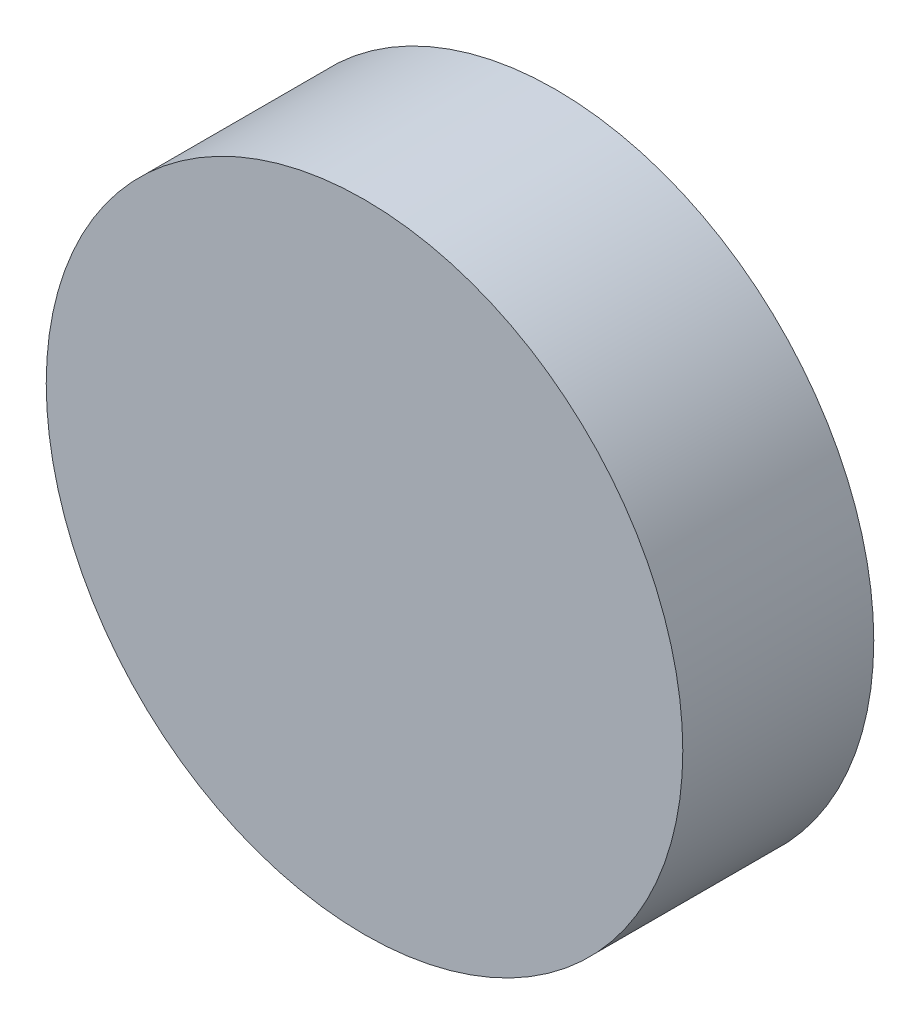
ISO-10303-21;
HEADER;
FILE_DESCRIPTION(('STEP AP214'),'2;1');
FILE_NAME('part.step','',(''),(''),'','','');
FILE_SCHEMA(('AUTOMOTIVE_DESIGN { 1 0 10303 214 1 1 1 1 }'));
ENDSEC;
DATA;
#1=APPLICATION_CONTEXT('core data for automotive mechanical design processes');
#2=APPLICATION_PROTOCOL_DEFINITION('international standard','automotive_design',2000,#1);
#3=PRODUCT_CONTEXT('',#1,'mechanical');
#4=PRODUCT('Part','Part','',(#3));
#5=PRODUCT_RELATED_PRODUCT_CATEGORY('part','',(#4));
#6=PRODUCT_DEFINITION_FORMATION('','',#4);
#7=PRODUCT_DEFINITION_CONTEXT('part definition',#1,'design');
#8=PRODUCT_DEFINITION('design','',#6,#7);
#9=PRODUCT_DEFINITION_SHAPE('','',#8);
#10=(LENGTH_UNIT() NAMED_UNIT(*) SI_UNIT(.MILLI.,.METRE.));
#11=(NAMED_UNIT(*) PLANE_ANGLE_UNIT() SI_UNIT($,.RADIAN.));
#12=(NAMED_UNIT(*) SI_UNIT($,.STERADIAN.) SOLID_ANGLE_UNIT());
#13=UNCERTAINTY_MEASURE_WITH_UNIT(LENGTH_MEASURE(1.E-05),#10,'distance_accuracy_value','');
#14=(GEOMETRIC_REPRESENTATION_CONTEXT(3) GLOBAL_UNCERTAINTY_ASSIGNED_CONTEXT((#13)) GLOBAL_UNIT_ASSIGNED_CONTEXT((#10,
#11,#12)) REPRESENTATION_CONTEXT('',''));
#15=CARTESIAN_POINT('',(0.,0.,0.));
#16=DIRECTION('',(0.,0.,1.));
#17=DIRECTION('',(1.,0.,0.));
#18=AXIS2_PLACEMENT_3D('',#15,#16,#17);
#19=CARTESIAN_POINT('',(0.,0.,0.));
#20=DIRECTION('',(0.,0.,1.));
#21=DIRECTION('',(1.,0.,0.));
#22=AXIS2_PLACEMENT_3D('',#19,#20,#21);
#23=PLANE('',#22);
#24=DIRECTION('',(0.475509024778266,-0.879710843035609,0.));
#25=VECTOR('',#24,1.);
#26=CARTESIAN_POINT('',(-4.90554595259711,0.137667135843847,0.));
#27=LINE('',#26,#25);
#28=CARTESIAN_POINT('',(-4.90554595259711,0.137667135843847,0.));
#29=VERTEX_POINT('',#28);
#30=CARTESIAN_POINT('',(-2.57199621320557,-4.17949384645911,0.));
#31=VERTEX_POINT('',#30);
#32=EDGE_CURVE('E134',#29,#31,#27,.T.);
#33=ORIENTED_EDGE('',*,*,#32,.F.);
#34=DIRECTION('',(-0.524097425664329,-0.851658316704547,0.));
#35=VECTOR('',#34,1.);
#36=CARTESIAN_POINT('',(-2.33354973939154,4.31716098230296,0.));
#37=LINE('',#36,#35);
#38=CARTESIAN_POINT('',(-2.33354973939154,4.31716098230296,0.));
#39=VERTEX_POINT('',#38);
#40=EDGE_CURVE('E85',#39,#29,#37,.T.);
#41=ORIENTED_EDGE('',*,*,#40,.F.);
#42=DIRECTION('',(-0.999606450442596,0.0280525263310623,0.));
#43=VECTOR('',#42,1.);
#44=CARTESIAN_POINT('',(2.57199621320557,4.17949384645911,0.));
#45=LINE('',#44,#43);
#46=CARTESIAN_POINT('',(2.57199621320557,4.17949384645911,0.));
#47=VERTEX_POINT('',#46);
#48=EDGE_CURVE('E143',#47,#39,#45,.T.);
#49=ORIENTED_EDGE('',*,*,#48,.F.);
#50=DIRECTION('',(-0.475509024778266,0.879710843035609,0.));
#51=VECTOR('',#50,1.);
#52=CARTESIAN_POINT('',(4.90554595259711,-0.137667135843847,0.));
#53=LINE('',#52,#51);
#54=CARTESIAN_POINT('',(4.90554595259711,-0.137667135843847,0.));
#55=VERTEX_POINT('',#54);
#56=EDGE_CURVE('E141',#55,#47,#53,.T.);
#57=ORIENTED_EDGE('',*,*,#56,.F.);
#58=DIRECTION('',(0.524097425664329,0.851658316704547,0.));
#59=VECTOR('',#58,1.);
#60=CARTESIAN_POINT('',(2.33354973939154,-4.31716098230296,0.));
#61=LINE('',#60,#59);
#62=CARTESIAN_POINT('',(2.33354973939154,-4.31716098230296,0.));
#63=VERTEX_POINT('',#62);
#64=EDGE_CURVE('E109',#63,#55,#61,.T.);
#65=ORIENTED_EDGE('',*,*,#64,.F.);
#66=DIRECTION('',(0.999606450442596,-0.0280525263310624,0.));
#67=VECTOR('',#66,1.);
#68=CARTESIAN_POINT('',(-2.57199621320557,-4.17949384645911,0.));
#69=LINE('',#68,#67);
#70=EDGE_CURVE('E137',#31,#63,#69,.T.);
#71=ORIENTED_EDGE('',*,*,#70,.F.);
#72=EDGE_LOOP('',(#33,#41,#49,#57,#65,#71));
#73=FACE_BOUND('',#72,.T.);
#74=DIRECTION('',(-0.475509024778266,0.879710843035609,0.));
#75=VECTOR('',#74,1.);
#76=CARTESIAN_POINT('',(4.21299828870105,-0.118231775489421,0.));
#77=LINE('',#76,#75);
#78=CARTESIAN_POINT('',(4.21299828870105,-0.118231775489422,0.));
#79=VERTEX_POINT('',#78);
#80=CARTESIAN_POINT('',(2.2088908654589,3.58944765637077,0.));
#81=VERTEX_POINT('',#80);
#82=EDGE_CURVE('E49',#79,#81,#77,.T.);
#83=ORIENTED_EDGE('',*,*,#82,.T.);
#84=DIRECTION('',(-0.999606450442595,0.0280525263310623,0.));
#85=VECTOR('',#84,1.);
#86=CARTESIAN_POINT('',(2.2088908654589,3.58944765637077,0.));
#87=LINE('',#86,#85);
#88=CARTESIAN_POINT('',(-2.00410742324215,3.70767943186019,0.));
#89=VERTEX_POINT('',#88);
#90=EDGE_CURVE('E188',#81,#89,#87,.T.);
#91=ORIENTED_EDGE('',*,*,#90,.T.);
#92=DIRECTION('',(-0.524097425664329,-0.851658316704547,0.));
#93=VECTOR('',#92,1.);
#94=CARTESIAN_POINT('',(-2.00410742324215,3.70767943186019,0.));
#95=LINE('',#94,#93);
#96=CARTESIAN_POINT('',(-4.21299828870105,0.118231775489422,0.));
#97=VERTEX_POINT('',#96);
#98=EDGE_CURVE('E185',#89,#97,#95,.T.);
#99=ORIENTED_EDGE('',*,*,#98,.T.);
#100=DIRECTION('',(0.475509024778266,-0.87971084303561,0.));
#101=VECTOR('',#100,1.);
#102=CARTESIAN_POINT('',(-4.21299828870105,0.118231775489422,0.));
#103=LINE('',#102,#101);
#104=CARTESIAN_POINT('',(-2.2088908654589,-3.58944765637077,0.));
#105=VERTEX_POINT('',#104);
#106=EDGE_CURVE('E182',#97,#105,#103,.T.);
#107=ORIENTED_EDGE('',*,*,#106,.T.);
#108=DIRECTION('',(0.999606450442595,-0.0280525263310624,0.));
#109=VECTOR('',#108,1.);
#110=CARTESIAN_POINT('',(-2.2088908654589,-3.58944765637077,0.));
#111=LINE('',#110,#109);
#112=CARTESIAN_POINT('',(2.00410742324215,-3.70767943186019,0.));
#113=VERTEX_POINT('',#112);
#114=EDGE_CURVE('E179',#105,#113,#111,.T.);
#115=ORIENTED_EDGE('',*,*,#114,.T.);
#116=DIRECTION('',(0.524097425664329,0.851658316704547,0.));
#117=VECTOR('',#116,1.);
#118=CARTESIAN_POINT('',(2.00410742324215,-3.70767943186019,0.));
#119=LINE('',#118,#117);
#120=EDGE_CURVE('E176',#113,#79,#119,.T.);
#121=ORIENTED_EDGE('',*,*,#120,.T.);
#122=EDGE_LOOP('',(#83,#91,#99,#107,#115,#121));
#123=FACE_BOUND('',#122,.T.);
#124=ADVANCED_FACE('F34',(#73,#123),#23,.F.);
#125=CARTESIAN_POINT('',(-4.90554595259711,0.137667135843847,2.));
#126=DIRECTION('',(0.879710843035609,0.475509024778266,0.));
#127=DIRECTION('',(-0.475509024778266,0.879710843035609,0.));
#128=AXIS2_PLACEMENT_3D('',#125,#126,#127);
#129=PLANE('',#128);
#130=ORIENTED_EDGE('',*,*,#32,.T.);
#131=DIRECTION('',(0.,0.,-1.));
#132=VECTOR('',#131,1.);
#133=CARTESIAN_POINT('',(-2.57199621320557,-4.17949384645911,2.));
#134=LINE('',#133,#132);
#135=CARTESIAN_POINT('',(-2.57199621320557,-4.17949384645911,2.));
#136=VERTEX_POINT('',#135);
#137=EDGE_CURVE('E11',#136,#31,#134,.T.);
#138=ORIENTED_EDGE('',*,*,#137,.F.);
#139=DIRECTION('',(0.475509024778266,-0.879710843035609,0.));
#140=VECTOR('',#139,1.);
#141=CARTESIAN_POINT('',(-4.90554595259711,0.137667135843847,2.));
#142=LINE('',#141,#140);
#143=CARTESIAN_POINT('',(-4.90554595259711,0.137667135843847,2.));
#144=VERTEX_POINT('',#143);
#145=EDGE_CURVE('E126',#144,#136,#142,.T.);
#146=ORIENTED_EDGE('',*,*,#145,.F.);
#147=DIRECTION('',(0.,0.,-1.));
#148=VECTOR('',#147,1.);
#149=CARTESIAN_POINT('',(-4.90554595259711,0.137667135843847,2.));
#150=LINE('',#149,#148);
#151=EDGE_CURVE('E133',#144,#29,#150,.T.);
#152=ORIENTED_EDGE('',*,*,#151,.T.);
#153=EDGE_LOOP('',(#130,#138,#146,#152));
#154=FACE_BOUND('',#153,.T.);
#155=ADVANCED_FACE('F36',(#154),#129,.F.);
#156=CARTESIAN_POINT('',(-2.57199621320557,-4.17949384645911,2.));
#157=DIRECTION('',(0.0280525263310624,0.999606450442595,0.));
#158=DIRECTION('',(-0.999606450442595,0.0280525263310624,0.));
#159=AXIS2_PLACEMENT_3D('',#156,#157,#158);
#160=PLANE('',#159);
#161=ORIENTED_EDGE('',*,*,#70,.T.);
#162=DIRECTION('',(0.,0.,-1.));
#163=VECTOR('',#162,1.);
#164=CARTESIAN_POINT('',(2.33354973939154,-4.31716098230296,2.));
#165=LINE('',#164,#163);
#166=CARTESIAN_POINT('',(2.33354973939154,-4.31716098230296,2.));
#167=VERTEX_POINT('',#166);
#168=EDGE_CURVE('E42',#167,#63,#165,.T.);
#169=ORIENTED_EDGE('',*,*,#168,.F.);
#170=DIRECTION('',(0.999606450442596,-0.0280525263310624,0.));
#171=VECTOR('',#170,1.);
#172=CARTESIAN_POINT('',(-2.57199621320557,-4.17949384645911,2.));
#173=LINE('',#172,#171);
#174=EDGE_CURVE('E93',#136,#167,#173,.T.);
#175=ORIENTED_EDGE('',*,*,#174,.F.);
#176=ORIENTED_EDGE('',*,*,#137,.T.);
#177=EDGE_LOOP('',(#161,#169,#175,#176));
#178=FACE_BOUND('',#177,.T.);
#179=ADVANCED_FACE('F272',(#178),#160,.F.);
#180=CARTESIAN_POINT('',(2.33354973939154,-4.31716098230296,2.));
#181=DIRECTION('',(-0.851658316704547,0.524097425664329,0.));
#182=DIRECTION('',(-0.524097425664329,-0.851658316704547,0.));
#183=AXIS2_PLACEMENT_3D('',#180,#181,#182);
#184=PLANE('',#183);
#185=ORIENTED_EDGE('',*,*,#64,.T.);
#186=DIRECTION('',(0.,0.,-1.));
#187=VECTOR('',#186,1.);
#188=CARTESIAN_POINT('',(4.90554595259711,-0.137667135843847,2.));
#189=LINE('',#188,#187);
#190=CARTESIAN_POINT('',(4.90554595259711,-0.137667135843847,2.));
#191=VERTEX_POINT('',#190);
#192=EDGE_CURVE('E102',#191,#55,#189,.T.);
#193=ORIENTED_EDGE('',*,*,#192,.F.);
#194=DIRECTION('',(0.524097425664329,0.851658316704547,0.));
#195=VECTOR('',#194,1.);
#196=CARTESIAN_POINT('',(2.33354973939154,-4.31716098230296,2.));
#197=LINE('',#196,#195);
#198=EDGE_CURVE('E107',#167,#191,#197,.T.);
#199=ORIENTED_EDGE('',*,*,#198,.F.);
#200=ORIENTED_EDGE('',*,*,#168,.T.);
#201=EDGE_LOOP('',(#185,#193,#199,#200));
#202=FACE_BOUND('',#201,.T.);
#203=ADVANCED_FACE('F104',(#202),#184,.F.);
#204=CARTESIAN_POINT('',(4.90554595259711,-0.137667135843847,2.));
#205=DIRECTION('',(-0.879710843035609,-0.475509024778266,0.));
#206=DIRECTION('',(0.475509024778266,-0.879710843035609,0.));
#207=AXIS2_PLACEMENT_3D('',#204,#205,#206);
#208=PLANE('',#207);
#209=ORIENTED_EDGE('',*,*,#56,.T.);
#210=DIRECTION('',(0.,0.,-1.));
#211=VECTOR('',#210,1.);
#212=CARTESIAN_POINT('',(2.57199621320557,4.17949384645911,2.));
#213=LINE('',#212,#211);
#214=CARTESIAN_POINT('',(2.57199621320557,4.17949384645911,2.));
#215=VERTEX_POINT('',#214);
#216=EDGE_CURVE('E112',#215,#47,#213,.T.);
#217=ORIENTED_EDGE('',*,*,#216,.F.);
#218=DIRECTION('',(-0.475509024778266,0.879710843035609,0.));
#219=VECTOR('',#218,1.);
#220=CARTESIAN_POINT('',(4.90554595259711,-0.137667135843847,2.));
#221=LINE('',#220,#219);
#222=EDGE_CURVE('E115',#191,#215,#221,.T.);
#223=ORIENTED_EDGE('',*,*,#222,.F.);
#224=ORIENTED_EDGE('',*,*,#192,.T.);
#225=EDGE_LOOP('',(#209,#217,#223,#224));
#226=FACE_BOUND('',#225,.T.);
#227=ADVANCED_FACE('F116',(#226),#208,.F.);
#228=CARTESIAN_POINT('',(2.57199621320557,4.17949384645911,2.));
#229=DIRECTION('',(-0.0280525263310623,-0.999606450442595,0.));
#230=DIRECTION('',(0.999606450442595,-0.0280525263310623,0.));
#231=AXIS2_PLACEMENT_3D('',#228,#229,#230);
#232=PLANE('',#231);
#233=ORIENTED_EDGE('',*,*,#48,.T.);
#234=DIRECTION('',(0.,0.,-1.));
#235=VECTOR('',#234,1.);
#236=CARTESIAN_POINT('',(-2.33354973939154,4.31716098230296,2.));
#237=LINE('',#236,#235);
#238=CARTESIAN_POINT('',(-2.33354973939154,4.31716098230296,2.));
#239=VERTEX_POINT('',#238);
#240=EDGE_CURVE('E58',#239,#39,#237,.T.);
#241=ORIENTED_EDGE('',*,*,#240,.F.);
#242=DIRECTION('',(-0.999606450442596,0.0280525263310623,0.));
#243=VECTOR('',#242,1.);
#244=CARTESIAN_POINT('',(2.57199621320557,4.17949384645911,2.));
#245=LINE('',#244,#243);
#246=EDGE_CURVE('E120',#215,#239,#245,.T.);
#247=ORIENTED_EDGE('',*,*,#246,.F.);
#248=ORIENTED_EDGE('',*,*,#216,.T.);
#249=EDGE_LOOP('',(#233,#241,#247,#248));
#250=FACE_BOUND('',#249,.T.);
#251=ADVANCED_FACE('F152',(#250),#232,.F.);
#252=CARTESIAN_POINT('',(-2.33354973939154,4.31716098230296,2.));
#253=DIRECTION('',(0.851658316704547,-0.524097425664329,0.));
#254=DIRECTION('',(0.524097425664329,0.851658316704547,0.));
#255=AXIS2_PLACEMENT_3D('',#252,#253,#254);
#256=PLANE('',#255);
#257=ORIENTED_EDGE('',*,*,#40,.T.);
#258=ORIENTED_EDGE('',*,*,#151,.F.);
#259=DIRECTION('',(-0.524097425664329,-0.851658316704547,0.));
#260=VECTOR('',#259,1.);
#261=CARTESIAN_POINT('',(-2.33354973939154,4.31716098230296,2.));
#262=LINE('',#261,#260);
#263=EDGE_CURVE('E131',#239,#144,#262,.T.);
#264=ORIENTED_EDGE('',*,*,#263,.F.);
#265=ORIENTED_EDGE('',*,*,#240,.T.);
#266=EDGE_LOOP('',(#257,#258,#264,#265));
#267=FACE_BOUND('',#266,.T.);
#268=ADVANCED_FACE('F158',(#267),#256,.F.);
#269=CARTESIAN_POINT('',(4.21299828870105,-0.118231775489421,2.));
#270=DIRECTION('',(-0.879710843035609,-0.475509024778266,0.));
#271=DIRECTION('',(0.475509024778266,-0.879710843035609,0.));
#272=AXIS2_PLACEMENT_3D('',#269,#270,#271);
#273=PLANE('',#272);
#274=ORIENTED_EDGE('',*,*,#82,.F.);
#275=DIRECTION('',(0.,0.,-1.));
#276=VECTOR('',#275,1.);
#277=CARTESIAN_POINT('',(4.21299828870105,-0.118231775489421,2.));
#278=LINE('',#277,#276);
#279=CARTESIAN_POINT('',(4.21299828870105,-0.118231775489421,4.));
#280=VERTEX_POINT('',#279);
#281=EDGE_CURVE('E174',#280,#79,#278,.T.);
#282=ORIENTED_EDGE('',*,*,#281,.F.);
#283=DIRECTION('',(0.475509024778266,-0.879710843035609,0.));
#284=VECTOR('',#283,1.);
#285=CARTESIAN_POINT('',(2.2088908654589,3.58944765637077,4.));
#286=LINE('',#285,#284);
#287=CARTESIAN_POINT('',(2.2088908654589,3.58944765637077,4.));
#288=VERTEX_POINT('',#287);
#289=EDGE_CURVE('E210',#288,#280,#286,.T.);
#290=ORIENTED_EDGE('',*,*,#289,.F.);
#291=DIRECTION('',(0.,0.,-1.));
#292=VECTOR('',#291,1.);
#293=CARTESIAN_POINT('',(2.2088908654589,3.58944765637077,2.));
#294=LINE('',#293,#292);
#295=EDGE_CURVE('E138',#288,#81,#294,.T.);
#296=ORIENTED_EDGE('',*,*,#295,.T.);
#297=EDGE_LOOP('',(#274,#282,#290,#296));
#298=FACE_BOUND('',#297,.T.);
#299=ADVANCED_FACE('F265',(#298),#273,.T.);
#300=CARTESIAN_POINT('',(2.2088908654589,3.58944765637077,2.));
#301=DIRECTION('',(-0.0280525263310623,-0.999606450442595,0.));
#302=DIRECTION('',(0.999606450442595,-0.0280525263310623,0.));
#303=AXIS2_PLACEMENT_3D('',#300,#301,#302);
#304=PLANE('',#303);
#305=ORIENTED_EDGE('',*,*,#90,.F.);
#306=ORIENTED_EDGE('',*,*,#295,.F.);
#307=DIRECTION('',(0.999606450442595,-0.0280525263310621,0.));
#308=VECTOR('',#307,1.);
#309=CARTESIAN_POINT('',(-2.00410742324215,3.70767943186019,4.));
#310=LINE('',#309,#308);
#311=CARTESIAN_POINT('',(-2.00410742324215,3.70767943186019,4.));
#312=VERTEX_POINT('',#311);
#313=EDGE_CURVE('E213',#312,#288,#310,.T.);
#314=ORIENTED_EDGE('',*,*,#313,.F.);
#315=DIRECTION('',(0.,0.,-1.));
#316=VECTOR('',#315,1.);
#317=CARTESIAN_POINT('',(-2.00410742324215,3.70767943186019,2.));
#318=LINE('',#317,#316);
#319=EDGE_CURVE('E162',#312,#89,#318,.T.);
#320=ORIENTED_EDGE('',*,*,#319,.T.);
#321=EDGE_LOOP('',(#305,#306,#314,#320));
#322=FACE_BOUND('',#321,.T.);
#323=ADVANCED_FACE('F226',(#322),#304,.T.);
#324=CARTESIAN_POINT('',(-2.00410742324215,3.70767943186019,2.));
#325=DIRECTION('',(0.851658316704547,-0.524097425664329,0.));
#326=DIRECTION('',(0.524097425664329,0.851658316704547,0.));
#327=AXIS2_PLACEMENT_3D('',#324,#325,#326);
#328=PLANE('',#327);
#329=ORIENTED_EDGE('',*,*,#98,.F.);
#330=ORIENTED_EDGE('',*,*,#319,.F.);
#331=DIRECTION('',(0.524097425664329,0.851658316704548,0.));
#332=VECTOR('',#331,1.);
#333=CARTESIAN_POINT('',(-4.21299828870105,0.118231775489419,4.));
#334=LINE('',#333,#332);
#335=CARTESIAN_POINT('',(-4.21299828870105,0.118231775489419,4.));
#336=VERTEX_POINT('',#335);
#337=EDGE_CURVE('E196',#336,#312,#334,.T.);
#338=ORIENTED_EDGE('',*,*,#337,.F.);
#339=DIRECTION('',(0.,0.,-1.));
#340=VECTOR('',#339,1.);
#341=CARTESIAN_POINT('',(-4.21299828870105,0.118231775489422,2.));
#342=LINE('',#341,#340);
#343=EDGE_CURVE('E165',#336,#97,#342,.T.);
#344=ORIENTED_EDGE('',*,*,#343,.T.);
#345=EDGE_LOOP('',(#329,#330,#338,#344));
#346=FACE_BOUND('',#345,.T.);
#347=ADVANCED_FACE('F257',(#346),#328,.T.);
#348=CARTESIAN_POINT('',(-4.21299828870105,0.118231775489422,2.));
#349=DIRECTION('',(0.879710843035609,0.475509024778266,0.));
#350=DIRECTION('',(-0.475509024778266,0.87971084303561,0.));
#351=AXIS2_PLACEMENT_3D('',#348,#349,#350);
#352=PLANE('',#351);
#353=ORIENTED_EDGE('',*,*,#106,.F.);
#354=ORIENTED_EDGE('',*,*,#343,.F.);
#355=DIRECTION('',(-0.475509024778266,0.879710843035609,0.));
#356=VECTOR('',#355,1.);
#357=CARTESIAN_POINT('',(-2.2088908654589,-3.58944765637077,4.));
#358=LINE('',#357,#356);
#359=CARTESIAN_POINT('',(-2.2088908654589,-3.58944765637077,4.));
#360=VERTEX_POINT('',#359);
#361=EDGE_CURVE('E201',#360,#336,#358,.T.);
#362=ORIENTED_EDGE('',*,*,#361,.F.);
#363=DIRECTION('',(0.,0.,-1.));
#364=VECTOR('',#363,1.);
#365=CARTESIAN_POINT('',(-2.2088908654589,-3.58944765637077,2.));
#366=LINE('',#365,#364);
#367=EDGE_CURVE('E168',#360,#105,#366,.T.);
#368=ORIENTED_EDGE('',*,*,#367,.T.);
#369=EDGE_LOOP('',(#353,#354,#362,#368));
#370=FACE_BOUND('',#369,.T.);
#371=ADVANCED_FACE('F256',(#370),#352,.T.);
#372=CARTESIAN_POINT('',(-2.2088908654589,-3.58944765637077,2.));
#373=DIRECTION('',(0.0280525263310624,0.999606450442595,0.));
#374=DIRECTION('',(-0.999606450442595,0.0280525263310624,0.));
#375=AXIS2_PLACEMENT_3D('',#372,#373,#374);
#376=PLANE('',#375);
#377=ORIENTED_EDGE('',*,*,#114,.F.);
#378=ORIENTED_EDGE('',*,*,#367,.F.);
#379=DIRECTION('',(-0.999606450442595,0.028052526331062,0.));
#380=VECTOR('',#379,1.);
#381=CARTESIAN_POINT('',(2.00410742324215,-3.70767943186019,4.));
#382=LINE('',#381,#380);
#383=CARTESIAN_POINT('',(2.00410742324215,-3.70767943186019,4.));
#384=VERTEX_POINT('',#383);
#385=EDGE_CURVE('E204',#384,#360,#382,.T.);
#386=ORIENTED_EDGE('',*,*,#385,.F.);
#387=DIRECTION('',(0.,0.,-1.));
#388=VECTOR('',#387,1.);
#389=CARTESIAN_POINT('',(2.00410742324215,-3.70767943186019,2.));
#390=LINE('',#389,#388);
#391=EDGE_CURVE('E171',#384,#113,#390,.T.);
#392=ORIENTED_EDGE('',*,*,#391,.T.);
#393=EDGE_LOOP('',(#377,#378,#386,#392));
#394=FACE_BOUND('',#393,.T.);
#395=ADVANCED_FACE('F251',(#394),#376,.T.);
#396=CARTESIAN_POINT('',(2.00410742324215,-3.70767943186019,2.));
#397=DIRECTION('',(-0.851658316704547,0.524097425664329,0.));
#398=DIRECTION('',(-0.524097425664329,-0.851658316704547,0.));
#399=AXIS2_PLACEMENT_3D('',#396,#397,#398);
#400=PLANE('',#399);
#401=ORIENTED_EDGE('',*,*,#120,.F.);
#402=ORIENTED_EDGE('',*,*,#391,.F.);
#403=DIRECTION('',(-0.524097425664329,-0.851658316704547,0.));
#404=VECTOR('',#403,1.);
#405=CARTESIAN_POINT('',(4.21299828870105,-0.118231775489421,4.));
#406=LINE('',#405,#404);
#407=EDGE_CURVE('E207',#280,#384,#406,.T.);
#408=ORIENTED_EDGE('',*,*,#407,.F.);
#409=ORIENTED_EDGE('',*,*,#281,.T.);
#410=EDGE_LOOP('',(#401,#402,#408,#409));
#411=FACE_BOUND('',#410,.T.);
#412=ADVANCED_FACE('F255',(#411),#400,.T.);
#413=CARTESIAN_POINT('',(0.,0.,2.));
#414=DIRECTION('',(0.,0.,1.));
#415=DIRECTION('',(1.,0.,0.));
#416=AXIS2_PLACEMENT_3D('',#413,#414,#415);
#417=PLANE('',#416);
#418=CARTESIAN_POINT('',(0.,0.,2.));
#419=DIRECTION('',(0.,0.,1.));
#420=DIRECTION('',(1.,0.,0.));
#421=AXIS2_PLACEMENT_3D('',#418,#419,#420);
#422=CIRCLE('',#421,10.);
#423=CARTESIAN_POINT('',(10.,0.,2.));
#424=VERTEX_POINT('',#423);
#425=EDGE_CURVE('E193',#424,#424,#422,.T.);
#426=ORIENTED_EDGE('',*,*,#425,.F.);
#427=EDGE_LOOP('',(#426));
#428=FACE_BOUND('',#427,.T.);
#429=ORIENTED_EDGE('',*,*,#263,.T.);
#430=ORIENTED_EDGE('',*,*,#145,.T.);
#431=ORIENTED_EDGE('',*,*,#174,.T.);
#432=ORIENTED_EDGE('',*,*,#198,.T.);
#433=ORIENTED_EDGE('',*,*,#222,.T.);
#434=ORIENTED_EDGE('',*,*,#246,.T.);
#435=EDGE_LOOP('',(#429,#430,#431,#432,#433,#434));
#436=FACE_BOUND('',#435,.T.);
#437=ADVANCED_FACE('F123',(#428,#436),#417,.F.);
#438=CARTESIAN_POINT('',(0.,0.,8.));
#439=DIRECTION('',(0.,0.,-1.));
#440=DIRECTION('',(-1.,0.,0.));
#441=AXIS2_PLACEMENT_3D('',#438,#439,#440);
#442=CYLINDRICAL_SURFACE('',#441,10.);
#443=CARTESIAN_POINT('',(0.,0.,8.));
#444=DIRECTION('',(0.,0.,1.));
#445=DIRECTION('',(1.,0.,0.));
#446=AXIS2_PLACEMENT_3D('',#443,#444,#445);
#447=CIRCLE('',#446,10.);
#448=CARTESIAN_POINT('',(10.,0.,8.));
#449=VERTEX_POINT('',#448);
#450=EDGE_CURVE('E192',#449,#449,#447,.T.);
#451=ORIENTED_EDGE('',*,*,#450,.F.);
#452=EDGE_LOOP('',(#451));
#453=FACE_BOUND('',#452,.T.);
#454=ORIENTED_EDGE('',*,*,#425,.T.);
#455=EDGE_LOOP('',(#454));
#456=FACE_BOUND('',#455,.T.);
#457=ADVANCED_FACE('F362',(#453,#456),#442,.T.);
#458=CARTESIAN_POINT('',(0.,0.,8.));
#459=DIRECTION('',(0.,0.,1.));
#460=DIRECTION('',(1.,0.,0.));
#461=AXIS2_PLACEMENT_3D('',#458,#459,#460);
#462=PLANE('',#461);
#463=ORIENTED_EDGE('',*,*,#450,.T.);
#464=EDGE_LOOP('',(#463));
#465=FACE_BOUND('',#464,.T.);
#466=ADVANCED_FACE('F354',(#465),#462,.T.);
#467=CARTESIAN_POINT('',(0.,0.,4.));
#468=DIRECTION('',(0.,0.,-1.));
#469=DIRECTION('',(-1.,0.,0.));
#470=AXIS2_PLACEMENT_3D('',#467,#468,#469);
#471=PLANE('',#470);
#472=ORIENTED_EDGE('',*,*,#313,.T.);
#473=ORIENTED_EDGE('',*,*,#289,.T.);
#474=ORIENTED_EDGE('',*,*,#407,.T.);
#475=ORIENTED_EDGE('',*,*,#385,.T.);
#476=ORIENTED_EDGE('',*,*,#361,.T.);
#477=ORIENTED_EDGE('',*,*,#337,.T.);
#478=EDGE_LOOP('',(#472,#473,#474,#475,#476,#477));
#479=FACE_BOUND('',#478,.T.);
#480=ADVANCED_FACE('F218',(#479),#471,.T.);
#481=CLOSED_SHELL('',(#124,#155,#179,#203,#227,#251,#268,#299,#323,#347,#371,#395,#412,#437,
#457,#466,#480));
#482=MANIFOLD_SOLID_BREP('B2',#481);
#483=ADVANCED_BREP_SHAPE_REPRESENTATION('',(#18,#482),#14);
#484=SHAPE_DEFINITION_REPRESENTATION(#9,#483);
ENDSEC;
END-ISO-10303-21;
